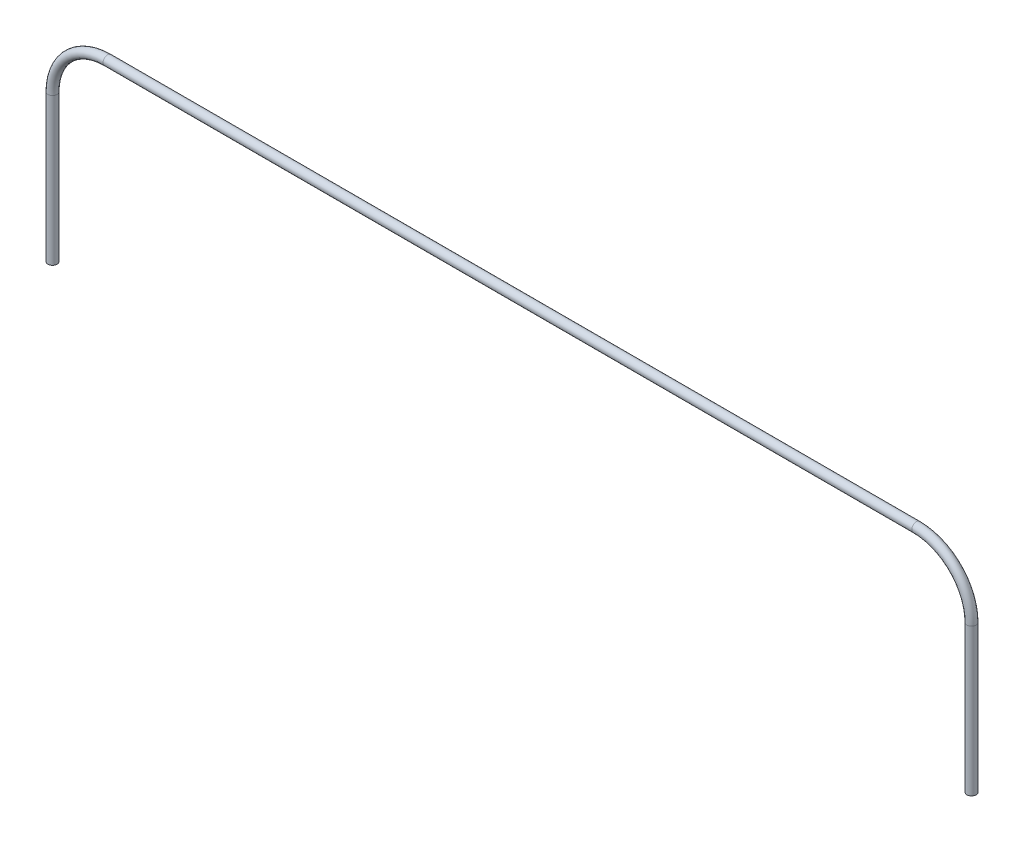
ISO-10303-21;
HEADER;
FILE_DESCRIPTION(('STEP AP214'),'2;1');
FILE_NAME('part.step','',(''),(''),'','','');
FILE_SCHEMA(('AUTOMOTIVE_DESIGN { 1 0 10303 214 1 1 1 1 }'));
ENDSEC;
DATA;
#1=APPLICATION_CONTEXT('core data for automotive mechanical design processes');
#2=APPLICATION_PROTOCOL_DEFINITION('international standard','automotive_design',2000,#1);
#3=PRODUCT_CONTEXT('',#1,'mechanical');
#4=PRODUCT('Part','Part','',(#3));
#5=PRODUCT_RELATED_PRODUCT_CATEGORY('part','',(#4));
#6=PRODUCT_DEFINITION_FORMATION('','',#4);
#7=PRODUCT_DEFINITION_CONTEXT('part definition',#1,'design');
#8=PRODUCT_DEFINITION('design','',#6,#7);
#9=PRODUCT_DEFINITION_SHAPE('','',#8);
#10=(LENGTH_UNIT() NAMED_UNIT(*) SI_UNIT(.MILLI.,.METRE.));
#11=(NAMED_UNIT(*) PLANE_ANGLE_UNIT() SI_UNIT($,.RADIAN.));
#12=(NAMED_UNIT(*) SI_UNIT($,.STERADIAN.) SOLID_ANGLE_UNIT());
#13=UNCERTAINTY_MEASURE_WITH_UNIT(LENGTH_MEASURE(1.E-05),#10,'distance_accuracy_value','');
#14=(GEOMETRIC_REPRESENTATION_CONTEXT(3) GLOBAL_UNCERTAINTY_ASSIGNED_CONTEXT((#13)) GLOBAL_UNIT_ASSIGNED_CONTEXT((#10,
#11,#12)) REPRESENTATION_CONTEXT('',''));
#15=CARTESIAN_POINT('',(0.,0.,0.));
#16=DIRECTION('',(0.,0.,1.));
#17=DIRECTION('',(1.,0.,0.));
#18=AXIS2_PLACEMENT_3D('',#15,#16,#17);
#19=CARTESIAN_POINT('',(50.,8.,0.));
#20=DIRECTION('',(0.,-1.,0.));
#21=DIRECTION('',(0.,0.,-1.));
#22=AXIS2_PLACEMENT_3D('',#19,#20,#21);
#23=CYLINDRICAL_SURFACE('',#22,0.25);
#24=CARTESIAN_POINT('',(50.,8.,0.));
#25=DIRECTION('',(0.,-1.,0.));
#26=DIRECTION('',(0.,0.,1.));
#27=AXIS2_PLACEMENT_3D('',#24,#25,#26);
#28=CIRCLE('',#27,0.25);
#29=CARTESIAN_POINT('',(50.25,8.,0.));
#30=VERTEX_POINT('',#29);
#31=EDGE_CURVE('E38',#30,#30,#28,.T.);
#32=ORIENTED_EDGE('',*,*,#31,.T.);
#33=EDGE_LOOP('',(#32));
#34=FACE_BOUND('',#33,.T.);
#35=CARTESIAN_POINT('',(50.,0.,0.));
#36=DIRECTION('',(0.,-1.,0.));
#37=DIRECTION('',(0.,0.,1.));
#38=AXIS2_PLACEMENT_3D('',#35,#36,#37);
#39=CIRCLE('',#38,0.25);
#40=CARTESIAN_POINT('',(50.,0.,0.25));
#41=VERTEX_POINT('',#40);
#42=EDGE_CURVE('E10',#41,#41,#39,.T.);
#43=ORIENTED_EDGE('',*,*,#42,.F.);
#44=EDGE_LOOP('',(#43));
#45=FACE_BOUND('',#44,.T.);
#46=ADVANCED_FACE('F32',(#34,#45),#23,.T.);
#47=CARTESIAN_POINT('',(47.,8.,0.));
#48=DIRECTION('',(0.,0.,-1.));
#49=DIRECTION('',(-1.,0.,0.));
#50=AXIS2_PLACEMENT_3D('',#47,#48,#49);
#51=TOROIDAL_SURFACE('',#50,3.,0.25);
#52=CARTESIAN_POINT('',(47.,11.,0.));
#53=DIRECTION('',(1.,0.,0.));
#54=DIRECTION('',(0.,0.,1.));
#55=AXIS2_PLACEMENT_3D('',#52,#53,#54);
#56=CIRCLE('',#55,0.25);
#57=CARTESIAN_POINT('',(47.,11.25,0.));
#58=VERTEX_POINT('',#57);
#59=EDGE_CURVE('E42',#58,#58,#56,.T.);
#60=CARTESIAN_POINT('',(47.,8.,0.));
#61=DIRECTION('',(0.,0.,-1.));
#62=DIRECTION('',(-1.,0.,0.));
#63=AXIS2_PLACEMENT_3D('',#60,#61,#62);
#64=CIRCLE('',#63,3.25);
#65=EDGE_CURVE('',#58,#30,#64,.T.);
#66=ORIENTED_EDGE('',*,*,#59,.T.);
#67=ORIENTED_EDGE('',*,*,#31,.F.);
#68=ORIENTED_EDGE('',*,*,#65,.T.);
#69=ORIENTED_EDGE('',*,*,#65,.F.);
#70=EDGE_LOOP('',(#66,#68,#67,#69));
#71=FACE_BOUND('',#70,.T.);
#72=ADVANCED_FACE('F76',(#71),#51,.T.);
#73=CARTESIAN_POINT('',(3.00000000000002,11.,0.));
#74=DIRECTION('',(1.,0.,0.));
#75=DIRECTION('',(0.,0.,-1.));
#76=AXIS2_PLACEMENT_3D('',#73,#74,#75);
#77=CYLINDRICAL_SURFACE('',#76,0.25);
#78=CARTESIAN_POINT('',(3.00000000000002,11.,0.));
#79=DIRECTION('',(1.,0.,0.));
#80=DIRECTION('',(0.,0.,1.));
#81=AXIS2_PLACEMENT_3D('',#78,#79,#80);
#82=CIRCLE('',#81,0.25);
#83=CARTESIAN_POINT('',(3.00000000000002,11.25,0.));
#84=VERTEX_POINT('',#83);
#85=EDGE_CURVE('E46',#84,#84,#82,.T.);
#86=ORIENTED_EDGE('',*,*,#85,.T.);
#87=EDGE_LOOP('',(#86));
#88=FACE_BOUND('',#87,.T.);
#89=ORIENTED_EDGE('',*,*,#59,.F.);
#90=EDGE_LOOP('',(#89));
#91=FACE_BOUND('',#90,.T.);
#92=ADVANCED_FACE('F80',(#88,#91),#77,.T.);
#93=CARTESIAN_POINT('',(3.,8.,0.));
#94=DIRECTION('',(0.,0.,-1.));
#95=DIRECTION('',(-1.,0.,0.));
#96=AXIS2_PLACEMENT_3D('',#93,#94,#95);
#97=TOROIDAL_SURFACE('',#96,3.,0.25);
#98=CARTESIAN_POINT('',(0.,7.99999999999998,0.));
#99=DIRECTION('',(0.,1.,0.));
#100=DIRECTION('',(0.,0.,1.));
#101=AXIS2_PLACEMENT_3D('',#98,#99,#100);
#102=CIRCLE('',#101,0.25);
#103=CARTESIAN_POINT('',(-0.25,7.99999999999998,0.));
#104=VERTEX_POINT('',#103);
#105=EDGE_CURVE('E51',#104,#104,#102,.T.);
#106=CARTESIAN_POINT('',(3.,8.,0.));
#107=DIRECTION('',(0.,0.,-1.));
#108=DIRECTION('',(-1.,0.,0.));
#109=AXIS2_PLACEMENT_3D('',#106,#107,#108);
#110=CIRCLE('',#109,3.25);
#111=EDGE_CURVE('',#104,#84,#110,.T.);
#112=ORIENTED_EDGE('',*,*,#105,.T.);
#113=ORIENTED_EDGE('',*,*,#85,.F.);
#114=ORIENTED_EDGE('',*,*,#111,.T.);
#115=ORIENTED_EDGE('',*,*,#111,.F.);
#116=EDGE_LOOP('',(#112,#114,#113,#115));
#117=FACE_BOUND('',#116,.T.);
#118=ADVANCED_FACE('F58',(#117),#97,.T.);
#119=CARTESIAN_POINT('',(0.,7.99999999999998,0.));
#120=DIRECTION('',(0.,-1.,0.));
#121=DIRECTION('',(0.,0.,-1.));
#122=AXIS2_PLACEMENT_3D('',#119,#120,#121);
#123=CYLINDRICAL_SURFACE('',#122,0.25);
#124=ORIENTED_EDGE('',*,*,#105,.F.);
#125=EDGE_LOOP('',(#124));
#126=FACE_BOUND('',#125,.T.);
#127=CARTESIAN_POINT('',(0.,0.,0.));
#128=DIRECTION('',(0.,1.,0.));
#129=DIRECTION('',(0.,0.,1.));
#130=AXIS2_PLACEMENT_3D('',#127,#128,#129);
#131=CIRCLE('',#130,0.25);
#132=CARTESIAN_POINT('',(0.,0.,0.25));
#133=VERTEX_POINT('',#132);
#134=EDGE_CURVE('E52',#133,#133,#131,.T.);
#135=ORIENTED_EDGE('',*,*,#134,.T.);
#136=EDGE_LOOP('',(#135));
#137=FACE_BOUND('',#136,.T.);
#138=ADVANCED_FACE('F61',(#126,#137),#123,.T.);
#139=CARTESIAN_POINT('',(50.,0.,0.));
#140=DIRECTION('',(0.,-1.,0.));
#141=DIRECTION('',(0.,0.,1.));
#142=AXIS2_PLACEMENT_3D('',#139,#140,#141);
#143=PLANE('',#142);
#144=ORIENTED_EDGE('',*,*,#42,.T.);
#145=EDGE_LOOP('',(#144));
#146=FACE_BOUND('',#145,.T.);
#147=ADVANCED_FACE('F64',(#146),#143,.T.);
#148=CARTESIAN_POINT('',(0.,0.,0.));
#149=DIRECTION('',(0.,1.,0.));
#150=DIRECTION('',(0.,0.,1.));
#151=AXIS2_PLACEMENT_3D('',#148,#149,#150);
#152=PLANE('',#151);
#153=ORIENTED_EDGE('',*,*,#134,.F.);
#154=EDGE_LOOP('',(#153));
#155=FACE_BOUND('',#154,.T.);
#156=ADVANCED_FACE('F68',(#155),#152,.F.);
#157=CLOSED_SHELL('',(#46,#72,#92,#118,#138,#147,#156));
#158=MANIFOLD_SOLID_BREP('B2',#157);
#159=ADVANCED_BREP_SHAPE_REPRESENTATION('',(#18,#158),#14);
#160=SHAPE_DEFINITION_REPRESENTATION(#9,#159);
ENDSEC;
END-ISO-10303-21;
